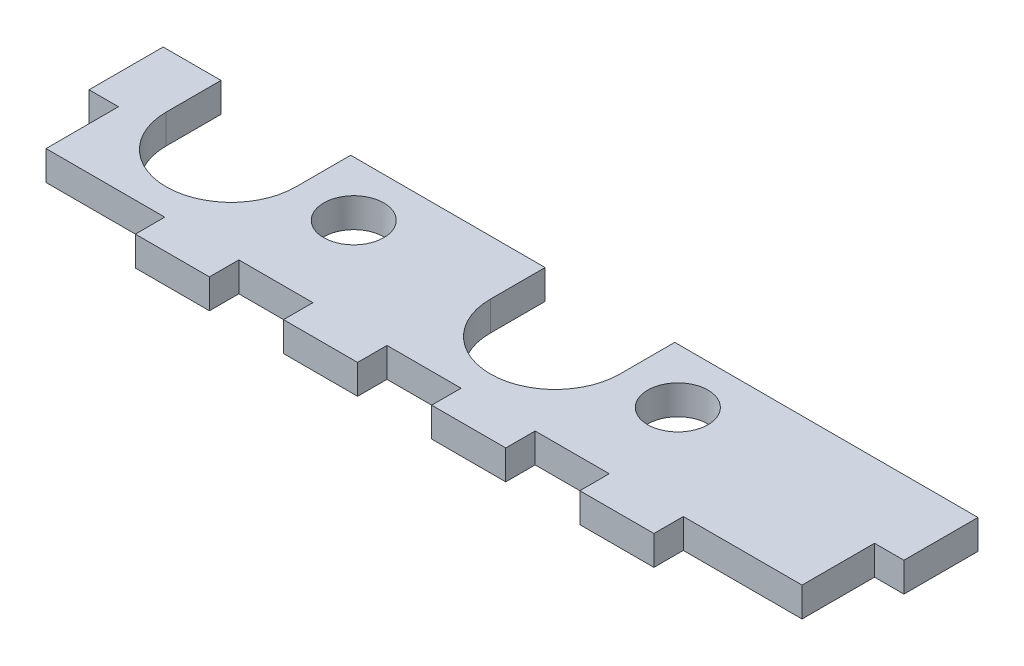
ISO-10303-21;
HEADER;
FILE_DESCRIPTION(('STEP AP214'),'2;1');
FILE_NAME('part.step','',(''),(''),'','','');
FILE_SCHEMA(('AUTOMOTIVE_DESIGN { 1 0 10303 214 1 1 1 1 }'));
ENDSEC;
DATA;
#1=APPLICATION_CONTEXT('core data for automotive mechanical design processes');
#2=APPLICATION_PROTOCOL_DEFINITION('international standard','automotive_design',2000,#1);
#3=PRODUCT_CONTEXT('',#1,'mechanical');
#4=PRODUCT('Part','Part','',(#3));
#5=PRODUCT_RELATED_PRODUCT_CATEGORY('part','',(#4));
#6=PRODUCT_DEFINITION_FORMATION('','',#4);
#7=PRODUCT_DEFINITION_CONTEXT('part definition',#1,'design');
#8=PRODUCT_DEFINITION('design','',#6,#7);
#9=PRODUCT_DEFINITION_SHAPE('','',#8);
#10=(LENGTH_UNIT() NAMED_UNIT(*) SI_UNIT(.MILLI.,.METRE.));
#11=(NAMED_UNIT(*) PLANE_ANGLE_UNIT() SI_UNIT($,.RADIAN.));
#12=(NAMED_UNIT(*) SI_UNIT($,.STERADIAN.) SOLID_ANGLE_UNIT());
#13=UNCERTAINTY_MEASURE_WITH_UNIT(LENGTH_MEASURE(1.E-05),#10,'distance_accuracy_value','');
#14=(GEOMETRIC_REPRESENTATION_CONTEXT(3) GLOBAL_UNCERTAINTY_ASSIGNED_CONTEXT((#13)) GLOBAL_UNIT_ASSIGNED_CONTEXT((#10,
#11,#12)) REPRESENTATION_CONTEXT('',''));
#15=CARTESIAN_POINT('',(0.,0.,0.));
#16=DIRECTION('',(0.,0.,1.));
#17=DIRECTION('',(1.,0.,0.));
#18=AXIS2_PLACEMENT_3D('',#15,#16,#17);
#19=CARTESIAN_POINT('',(0.,-0.00100000000000013,11.));
#20=DIRECTION('',(0.,0.,-1.));
#21=DIRECTION('',(-1.,0.,0.));
#22=AXIS2_PLACEMENT_3D('',#19,#20,#21);
#23=PLANE('',#22);
#24=DIRECTION('',(0.,1.,0.));
#25=VECTOR('',#24,1.);
#26=CARTESIAN_POINT('',(41.25,-0.00100000000000013,10.9999999999995));
#27=LINE('',#26,#25);
#28=CARTESIAN_POINT('',(41.25,0.,10.9999999999995));
#29=VERTEX_POINT('',#28);
#30=CARTESIAN_POINT('',(41.25,3.175,10.9999999999995));
#31=VERTEX_POINT('',#30);
#32=EDGE_CURVE('E306',#29,#31,#27,.T.);
#33=ORIENTED_EDGE('',*,*,#32,.F.);
#34=DIRECTION('',(1.,0.,0.));
#35=VECTOR('',#34,1.);
#36=CARTESIAN_POINT('',(0.,0.,11.));
#37=LINE('',#36,#35);
#38=CARTESIAN_POINT('',(20.25,0.,11.));
#39=VERTEX_POINT('',#38);
#40=EDGE_CURVE('E393',#39,#29,#37,.T.);
#41=ORIENTED_EDGE('',*,*,#40,.F.);
#42=DIRECTION('',(0.,1.,0.));
#43=VECTOR('',#42,1.);
#44=CARTESIAN_POINT('',(20.25,-0.00100000000000013,11.));
#45=LINE('',#44,#43);
#46=CARTESIAN_POINT('',(20.25,3.175,11.));
#47=VERTEX_POINT('',#46);
#48=EDGE_CURVE('E327',#39,#47,#45,.T.);
#49=ORIENTED_EDGE('',*,*,#48,.T.);
#50=DIRECTION('',(-1.,0.,0.));
#51=VECTOR('',#50,1.);
#52=CARTESIAN_POINT('',(0.,3.175,11.));
#53=LINE('',#52,#51);
#54=EDGE_CURVE('E88',#31,#47,#53,.T.);
#55=ORIENTED_EDGE('',*,*,#54,.F.);
#56=EDGE_LOOP('',(#33,#41,#49,#55));
#57=FACE_BOUND('',#56,.T.);
#58=ADVANCED_FACE('F63',(#57),#23,.T.);
#59=DIRECTION('',(0.,1.,0.));
#60=VECTOR('',#59,1.);
#61=CARTESIAN_POINT('',(6.25,-0.00100000000000013,11.));
#62=LINE('',#61,#60);
#63=CARTESIAN_POINT('',(6.25,0.,11.));
#64=VERTEX_POINT('',#63);
#65=CARTESIAN_POINT('',(6.25,3.175,11.));
#66=VERTEX_POINT('',#65);
#67=EDGE_CURVE('E325',#64,#66,#62,.T.);
#68=ORIENTED_EDGE('',*,*,#67,.F.);
#69=CARTESIAN_POINT('',(0.,0.,11.));
#70=VERTEX_POINT('',#69);
#71=EDGE_CURVE('E389',#70,#64,#37,.T.);
#72=ORIENTED_EDGE('',*,*,#71,.F.);
#73=DIRECTION('',(0.,1.,0.));
#74=VECTOR('',#73,1.);
#75=CARTESIAN_POINT('',(0.,-0.00100000000000013,11.));
#76=LINE('',#75,#74);
#77=CARTESIAN_POINT('',(0.,3.175,11.));
#78=VERTEX_POINT('',#77);
#79=EDGE_CURVE('E346',#70,#78,#76,.T.);
#80=ORIENTED_EDGE('',*,*,#79,.T.);
#81=EDGE_CURVE('E384',#66,#78,#53,.T.);
#82=ORIENTED_EDGE('',*,*,#81,.F.);
#83=EDGE_LOOP('',(#68,#72,#80,#82));
#84=FACE_BOUND('',#83,.T.);
#85=ADVANCED_FACE('F582',(#84),#23,.T.);
#86=CARTESIAN_POINT('',(0.,3.175,30.));
#87=DIRECTION('',(0.,0.,-1.));
#88=DIRECTION('',(-1.,0.,0.));
#89=AXIS2_PLACEMENT_3D('',#86,#87,#88);
#90=PLANE('',#89);
#91=DIRECTION('',(0.,1.,0.));
#92=VECTOR('',#91,1.);
#93=CARTESIAN_POINT('',(72.,-0.00100000000000013,30.));
#94=LINE('',#93,#92);
#95=CARTESIAN_POINT('',(72.,0.,30.));
#96=VERTEX_POINT('',#95);
#97=CARTESIAN_POINT('',(72.,3.175,30.));
#98=VERTEX_POINT('',#97);
#99=EDGE_CURVE('E352',#96,#98,#94,.T.);
#100=ORIENTED_EDGE('',*,*,#99,.T.);
#101=DIRECTION('',(1.,0.,0.));
#102=VECTOR('',#101,1.);
#103=CARTESIAN_POINT('',(0.,3.175,30.));
#104=LINE('',#103,#102);
#105=CARTESIAN_POINT('',(64.,3.175,30.));
#106=VERTEX_POINT('',#105);
#107=EDGE_CURVE('E507',#106,#98,#104,.T.);
#108=ORIENTED_EDGE('',*,*,#107,.F.);
#109=DIRECTION('',(0.,1.,0.));
#110=VECTOR('',#109,1.);
#111=CARTESIAN_POINT('',(64.,-0.00100000000000013,30.));
#112=LINE('',#111,#110);
#113=CARTESIAN_POINT('',(64.,0.,30.));
#114=VERTEX_POINT('',#113);
#115=EDGE_CURVE('E449',#114,#106,#112,.T.);
#116=ORIENTED_EDGE('',*,*,#115,.F.);
#117=DIRECTION('',(1.,0.,0.));
#118=VECTOR('',#117,1.);
#119=CARTESIAN_POINT('',(0.,0.,30.));
#120=LINE('',#119,#118);
#121=EDGE_CURVE('E511',#114,#96,#120,.T.);
#122=ORIENTED_EDGE('',*,*,#121,.T.);
#123=EDGE_LOOP('',(#100,#108,#116,#122));
#124=FACE_BOUND('',#123,.T.);
#125=ADVANCED_FACE('F547',(#124),#90,.F.);
#126=DIRECTION('',(0.,1.,0.));
#127=VECTOR('',#126,1.);
#128=CARTESIAN_POINT('',(56.,-0.00100000000000013,30.));
#129=LINE('',#128,#127);
#130=CARTESIAN_POINT('',(56.,0.,30.));
#131=VERTEX_POINT('',#130);
#132=CARTESIAN_POINT('',(56.,3.175,30.));
#133=VERTEX_POINT('',#132);
#134=EDGE_CURVE('E448',#131,#133,#129,.T.);
#135=ORIENTED_EDGE('',*,*,#134,.T.);
#136=CARTESIAN_POINT('',(48.,3.175,30.));
#137=VERTEX_POINT('',#136);
#138=EDGE_CURVE('E542',#137,#133,#104,.T.);
#139=ORIENTED_EDGE('',*,*,#138,.F.);
#140=DIRECTION('',(0.,1.,0.));
#141=VECTOR('',#140,1.);
#142=CARTESIAN_POINT('',(48.,-0.00100000000000013,30.));
#143=LINE('',#142,#141);
#144=CARTESIAN_POINT('',(48.,0.,30.));
#145=VERTEX_POINT('',#144);
#146=EDGE_CURVE('E425',#145,#137,#143,.T.);
#147=ORIENTED_EDGE('',*,*,#146,.F.);
#148=EDGE_CURVE('E520',#145,#131,#120,.T.);
#149=ORIENTED_EDGE('',*,*,#148,.T.);
#150=EDGE_LOOP('',(#135,#139,#147,#149));
#151=FACE_BOUND('',#150,.T.);
#152=ADVANCED_FACE('F529',(#151),#90,.F.);
#153=DIRECTION('',(0.,1.,0.));
#154=VECTOR('',#153,1.);
#155=CARTESIAN_POINT('',(40.,-0.00100000000000013,30.));
#156=LINE('',#155,#154);
#157=CARTESIAN_POINT('',(40.,0.,30.));
#158=VERTEX_POINT('',#157);
#159=CARTESIAN_POINT('',(40.,3.175,30.));
#160=VERTEX_POINT('',#159);
#161=EDGE_CURVE('E421',#158,#160,#156,.T.);
#162=ORIENTED_EDGE('',*,*,#161,.T.);
#163=CARTESIAN_POINT('',(32.,3.175,30.));
#164=VERTEX_POINT('',#163);
#165=EDGE_CURVE('E509',#164,#160,#104,.T.);
#166=ORIENTED_EDGE('',*,*,#165,.F.);
#167=DIRECTION('',(0.,1.,0.));
#168=VECTOR('',#167,1.);
#169=CARTESIAN_POINT('',(32.,-0.00100000000000013,30.));
#170=LINE('',#169,#168);
#171=CARTESIAN_POINT('',(32.,0.,30.));
#172=VERTEX_POINT('',#171);
#173=EDGE_CURVE('E398',#172,#164,#170,.T.);
#174=ORIENTED_EDGE('',*,*,#173,.F.);
#175=EDGE_CURVE('E514',#172,#158,#120,.T.);
#176=ORIENTED_EDGE('',*,*,#175,.T.);
#177=EDGE_LOOP('',(#162,#166,#174,#176));
#178=FACE_BOUND('',#177,.T.);
#179=ADVANCED_FACE('F618',(#178),#90,.F.);
#180=DIRECTION('',(0.,1.,0.));
#181=VECTOR('',#180,1.);
#182=CARTESIAN_POINT('',(24.,-0.00100000000000013,30.));
#183=LINE('',#182,#181);
#184=CARTESIAN_POINT('',(24.,0.,30.));
#185=VERTEX_POINT('',#184);
#186=CARTESIAN_POINT('',(24.,3.175,30.));
#187=VERTEX_POINT('',#186);
#188=EDGE_CURVE('E396',#185,#187,#183,.T.);
#189=ORIENTED_EDGE('',*,*,#188,.T.);
#190=CARTESIAN_POINT('',(16.,3.175,30.));
#191=VERTEX_POINT('',#190);
#192=EDGE_CURVE('E72',#191,#187,#104,.T.);
#193=ORIENTED_EDGE('',*,*,#192,.F.);
#194=DIRECTION('',(0.,1.,0.));
#195=VECTOR('',#194,1.);
#196=CARTESIAN_POINT('',(16.,-0.00100000000000013,30.));
#197=LINE('',#196,#195);
#198=CARTESIAN_POINT('',(16.,0.,30.));
#199=VERTEX_POINT('',#198);
#200=EDGE_CURVE('E496',#199,#191,#197,.T.);
#201=ORIENTED_EDGE('',*,*,#200,.F.);
#202=EDGE_CURVE('E512',#199,#185,#120,.T.);
#203=ORIENTED_EDGE('',*,*,#202,.T.);
#204=EDGE_LOOP('',(#189,#193,#201,#203));
#205=FACE_BOUND('',#204,.T.);
#206=ADVANCED_FACE('F601',(#205),#90,.F.);
#207=CARTESIAN_POINT('',(88.,3.175,0.));
#208=DIRECTION('',(-1.,0.,0.));
#209=DIRECTION('',(0.,0.,1.));
#210=AXIS2_PLACEMENT_3D('',#207,#208,#209);
#211=PLANE('',#210);
#212=DIRECTION('',(0.,1.,0.));
#213=VECTOR('',#212,1.);
#214=CARTESIAN_POINT('',(88.,-0.00100000000000013,11.));
#215=LINE('',#214,#213);
#216=CARTESIAN_POINT('',(88.,0.,11.));
#217=VERTEX_POINT('',#216);
#218=CARTESIAN_POINT('',(88.,3.175,11.));
#219=VERTEX_POINT('',#218);
#220=EDGE_CURVE('E349',#217,#219,#215,.T.);
#221=ORIENTED_EDGE('',*,*,#220,.T.);
#222=DIRECTION('',(0.,0.,-1.));
#223=VECTOR('',#222,1.);
#224=CARTESIAN_POINT('',(88.,3.175,0.));
#225=LINE('',#224,#223);
#226=CARTESIAN_POINT('',(88.,3.175,19.));
#227=VERTEX_POINT('',#226);
#228=EDGE_CURVE('E12',#227,#219,#225,.T.);
#229=ORIENTED_EDGE('',*,*,#228,.F.);
#230=DIRECTION('',(0.,1.,0.));
#231=VECTOR('',#230,1.);
#232=CARTESIAN_POINT('',(88.,-0.00100000000000013,19.));
#233=LINE('',#232,#231);
#234=CARTESIAN_POINT('',(88.,0.,19.));
#235=VERTEX_POINT('',#234);
#236=EDGE_CURVE('E353',#235,#227,#233,.T.);
#237=ORIENTED_EDGE('',*,*,#236,.F.);
#238=DIRECTION('',(0.,0.,-1.));
#239=VECTOR('',#238,1.);
#240=CARTESIAN_POINT('',(88.,0.,0.));
#241=LINE('',#240,#239);
#242=EDGE_CURVE('E67',#235,#217,#241,.T.);
#243=ORIENTED_EDGE('',*,*,#242,.T.);
#244=EDGE_LOOP('',(#221,#229,#237,#243));
#245=FACE_BOUND('',#244,.T.);
#246=ADVANCED_FACE('F565',(#245),#211,.F.);
#247=CARTESIAN_POINT('',(0.,3.175,0.));
#248=DIRECTION('',(0.,1.,0.));
#249=DIRECTION('',(0.,0.,1.));
#250=AXIS2_PLACEMENT_3D('',#247,#248,#249);
#251=PLANE('',#250);
#252=DIRECTION('',(0.,0.,1.));
#253=VECTOR('',#252,1.);
#254=CARTESIAN_POINT('',(41.25,3.175,16.9149999999995));
#255=LINE('',#254,#253);
#256=CARTESIAN_POINT('',(41.25,3.175,16.9149999999995));
#257=VERTEX_POINT('',#256);
#258=EDGE_CURVE('E285',#31,#257,#255,.T.);
#259=ORIENTED_EDGE('',*,*,#258,.F.);
#260=ORIENTED_EDGE('',*,*,#54,.T.);
#261=DIRECTION('',(0.,0.,-1.));
#262=VECTOR('',#261,1.);
#263=CARTESIAN_POINT('',(20.25,3.175,16.915));
#264=LINE('',#263,#262);
#265=CARTESIAN_POINT('',(20.25,3.175,16.915));
#266=VERTEX_POINT('',#265);
#267=EDGE_CURVE('E316',#266,#47,#264,.T.);
#268=ORIENTED_EDGE('',*,*,#267,.F.);
#269=CARTESIAN_POINT('',(13.25,3.175,16.915));
#270=DIRECTION('',(0.,1.,0.));
#271=DIRECTION('',(0.,0.,1.));
#272=AXIS2_PLACEMENT_3D('',#269,#270,#271);
#273=CIRCLE('',#272,7.);
#274=CARTESIAN_POINT('',(6.25,3.175,16.915));
#275=VERTEX_POINT('',#274);
#276=EDGE_CURVE('E313',#275,#266,#273,.T.);
#277=ORIENTED_EDGE('',*,*,#276,.F.);
#278=DIRECTION('',(0.,0.,1.));
#279=VECTOR('',#278,1.);
#280=CARTESIAN_POINT('',(6.25,3.175,16.915));
#281=LINE('',#280,#279);
#282=EDGE_CURVE('E318',#66,#275,#281,.T.);
#283=ORIENTED_EDGE('',*,*,#282,.F.);
#284=ORIENTED_EDGE('',*,*,#81,.T.);
#285=DIRECTION('',(0.,0.,1.));
#286=VECTOR('',#285,1.);
#287=CARTESIAN_POINT('',(0.,3.175,0.));
#288=LINE('',#287,#286);
#289=CARTESIAN_POINT('',(0.,3.175,19.));
#290=VERTEX_POINT('',#289);
#291=EDGE_CURVE('E505',#78,#290,#288,.T.);
#292=ORIENTED_EDGE('',*,*,#291,.T.);
#293=DIRECTION('',(1.,0.,0.));
#294=VECTOR('',#293,1.);
#295=CARTESIAN_POINT('',(0.,3.175,19.));
#296=LINE('',#295,#294);
#297=CARTESIAN_POINT('',(3.175,3.175,19.));
#298=VERTEX_POINT('',#297);
#299=EDGE_CURVE('E481',#290,#298,#296,.T.);
#300=ORIENTED_EDGE('',*,*,#299,.T.);
#301=DIRECTION('',(0.,0.,1.));
#302=VECTOR('',#301,1.);
#303=CARTESIAN_POINT('',(3.175,3.175,0.));
#304=LINE('',#303,#302);
#305=CARTESIAN_POINT('',(3.175,3.175,26.825));
#306=VERTEX_POINT('',#305);
#307=EDGE_CURVE('E478',#298,#306,#304,.T.);
#308=ORIENTED_EDGE('',*,*,#307,.T.);
#309=DIRECTION('',(1.,0.,0.));
#310=VECTOR('',#309,1.);
#311=CARTESIAN_POINT('',(0.,3.175,26.825));
#312=LINE('',#311,#310);
#313=CARTESIAN_POINT('',(16.,3.175,26.825));
#314=VERTEX_POINT('',#313);
#315=EDGE_CURVE('E487',#306,#314,#312,.T.);
#316=ORIENTED_EDGE('',*,*,#315,.T.);
#317=DIRECTION('',(0.,0.,-1.));
#318=VECTOR('',#317,1.);
#319=CARTESIAN_POINT('',(16.,3.175,0.));
#320=LINE('',#319,#318);
#321=EDGE_CURVE('E484',#191,#314,#320,.T.);
#322=ORIENTED_EDGE('',*,*,#321,.F.);
#323=ORIENTED_EDGE('',*,*,#192,.T.);
#324=DIRECTION('',(0.,0.,-1.));
#325=VECTOR('',#324,1.);
#326=CARTESIAN_POINT('',(24.,3.175,0.));
#327=LINE('',#326,#325);
#328=CARTESIAN_POINT('',(24.,3.175,26.825));
#329=VERTEX_POINT('',#328);
#330=EDGE_CURVE('E400',#187,#329,#327,.T.);
#331=ORIENTED_EDGE('',*,*,#330,.T.);
#332=DIRECTION('',(-1.,0.,0.));
#333=VECTOR('',#332,1.);
#334=CARTESIAN_POINT('',(0.,3.175,26.825));
#335=LINE('',#334,#333);
#336=CARTESIAN_POINT('',(32.,3.175,26.825));
#337=VERTEX_POINT('',#336);
#338=EDGE_CURVE('E409',#337,#329,#335,.T.);
#339=ORIENTED_EDGE('',*,*,#338,.F.);
#340=DIRECTION('',(0.,0.,-1.));
#341=VECTOR('',#340,1.);
#342=CARTESIAN_POINT('',(32.,3.175,0.));
#343=LINE('',#342,#341);
#344=EDGE_CURVE('E412',#164,#337,#343,.T.);
#345=ORIENTED_EDGE('',*,*,#344,.F.);
#346=ORIENTED_EDGE('',*,*,#165,.T.);
#347=DIRECTION('',(0.,0.,-1.));
#348=VECTOR('',#347,1.);
#349=CARTESIAN_POINT('',(40.,3.175,0.));
#350=LINE('',#349,#348);
#351=CARTESIAN_POINT('',(40.,3.175,26.825));
#352=VERTEX_POINT('',#351);
#353=EDGE_CURVE('E437',#160,#352,#350,.T.);
#354=ORIENTED_EDGE('',*,*,#353,.T.);
#355=DIRECTION('',(1.,0.,0.));
#356=VECTOR('',#355,1.);
#357=CARTESIAN_POINT('',(0.,3.175,26.825));
#358=LINE('',#357,#356);
#359=CARTESIAN_POINT('',(48.,3.175,26.825));
#360=VERTEX_POINT('',#359);
#361=EDGE_CURVE('E424',#352,#360,#358,.T.);
#362=ORIENTED_EDGE('',*,*,#361,.T.);
#363=DIRECTION('',(0.,0.,-1.));
#364=VECTOR('',#363,1.);
#365=CARTESIAN_POINT('',(48.,3.175,0.));
#366=LINE('',#365,#364);
#367=EDGE_CURVE('E434',#137,#360,#366,.T.);
#368=ORIENTED_EDGE('',*,*,#367,.F.);
#369=ORIENTED_EDGE('',*,*,#138,.T.);
#370=DIRECTION('',(0.,0.,-1.));
#371=VECTOR('',#370,1.);
#372=CARTESIAN_POINT('',(56.,3.175,0.));
#373=LINE('',#372,#371);
#374=CARTESIAN_POINT('',(56.,3.175,26.825));
#375=VERTEX_POINT('',#374);
#376=EDGE_CURVE('E451',#133,#375,#373,.T.);
#377=ORIENTED_EDGE('',*,*,#376,.T.);
#378=DIRECTION('',(1.,0.,0.));
#379=VECTOR('',#378,1.);
#380=CARTESIAN_POINT('',(0.,3.175,26.825));
#381=LINE('',#380,#379);
#382=CARTESIAN_POINT('',(64.,3.175,26.825));
#383=VERTEX_POINT('',#382);
#384=EDGE_CURVE('E460',#375,#383,#381,.T.);
#385=ORIENTED_EDGE('',*,*,#384,.T.);
#386=DIRECTION('',(0.,0.,-1.));
#387=VECTOR('',#386,1.);
#388=CARTESIAN_POINT('',(64.,3.175,0.));
#389=LINE('',#388,#387);
#390=EDGE_CURVE('E463',#106,#383,#389,.T.);
#391=ORIENTED_EDGE('',*,*,#390,.F.);
#392=ORIENTED_EDGE('',*,*,#107,.T.);
#393=DIRECTION('',(0.,0.,-1.));
#394=VECTOR('',#393,1.);
#395=CARTESIAN_POINT('',(72.,3.175,0.));
#396=LINE('',#395,#394);
#397=CARTESIAN_POINT('',(72.,3.175,26.825));
#398=VERTEX_POINT('',#397);
#399=EDGE_CURVE('E355',#98,#398,#396,.T.);
#400=ORIENTED_EDGE('',*,*,#399,.T.);
#401=DIRECTION('',(-1.,0.,0.));
#402=VECTOR('',#401,1.);
#403=CARTESIAN_POINT('',(0.,3.175,26.825));
#404=LINE('',#403,#402);
#405=CARTESIAN_POINT('',(84.825,3.175,26.825));
#406=VERTEX_POINT('',#405);
#407=EDGE_CURVE('E366',#406,#398,#404,.T.);
#408=ORIENTED_EDGE('',*,*,#407,.F.);
#409=DIRECTION('',(0.,0.,1.));
#410=VECTOR('',#409,1.);
#411=CARTESIAN_POINT('',(84.825,3.175,0.));
#412=LINE('',#411,#410);
#413=CARTESIAN_POINT('',(84.825,3.175,19.));
#414=VERTEX_POINT('',#413);
#415=EDGE_CURVE('E369',#414,#406,#412,.T.);
#416=ORIENTED_EDGE('',*,*,#415,.F.);
#417=DIRECTION('',(-1.,0.,0.));
#418=VECTOR('',#417,1.);
#419=CARTESIAN_POINT('',(0.,3.175,19.));
#420=LINE('',#419,#418);
#421=EDGE_CURVE('E372',#227,#414,#420,.T.);
#422=ORIENTED_EDGE('',*,*,#421,.F.);
#423=ORIENTED_EDGE('',*,*,#228,.T.);
#424=CARTESIAN_POINT('',(55.25,3.175,11.));
#425=VERTEX_POINT('',#424);
#426=EDGE_CURVE('E385',#219,#425,#53,.T.);
#427=ORIENTED_EDGE('',*,*,#426,.T.);
#428=DIRECTION('',(0.,0.,-1.));
#429=VECTOR('',#428,1.);
#430=CARTESIAN_POINT('',(55.25,3.175,16.9149999999995));
#431=LINE('',#430,#429);
#432=CARTESIAN_POINT('',(55.25,3.175,16.9149999999995));
#433=VERTEX_POINT('',#432);
#434=EDGE_CURVE('E80',#433,#425,#431,.T.);
#435=ORIENTED_EDGE('',*,*,#434,.F.);
#436=CARTESIAN_POINT('',(48.25,3.175,16.9149999999995));
#437=DIRECTION('',(0.,1.,0.));
#438=DIRECTION('',(0.,0.,1.));
#439=AXIS2_PLACEMENT_3D('',#436,#437,#438);
#440=CIRCLE('',#439,7.);
#441=EDGE_CURVE('E283',#257,#433,#440,.T.);
#442=ORIENTED_EDGE('',*,*,#441,.F.);
#443=EDGE_LOOP('',(#259,#260,#268,#277,#283,#284,#292,#300,#308,#316,#322,#323,#331,#339,#345,
#346,#354,#362,#368,#369,#377,#385,#391,#392,#400,#408,#416,#422,#423,#427,#435,#442));
#444=FACE_BOUND('',#443,.T.);
#445=CARTESIAN_POINT('',(26.5,3.175,16.915));
#446=DIRECTION('',(0.,1.,0.));
#447=DIRECTION('',(0.,0.,-1.));
#448=AXIS2_PLACEMENT_3D('',#445,#446,#447);
#449=CIRCLE('',#448,3.24999999999999);
#450=CARTESIAN_POINT('',(26.5,3.175,13.665));
#451=VERTEX_POINT('',#450);
#452=EDGE_CURVE('E333',#451,#451,#449,.T.);
#453=ORIENTED_EDGE('',*,*,#452,.F.);
#454=EDGE_LOOP('',(#453));
#455=FACE_BOUND('',#454,.T.);
#456=CARTESIAN_POINT('',(61.5,3.175,16.915));
#457=DIRECTION('',(0.,1.,0.));
#458=DIRECTION('',(0.,0.,1.));
#459=AXIS2_PLACEMENT_3D('',#456,#457,#458);
#460=CIRCLE('',#459,3.24999999999999);
#461=CARTESIAN_POINT('',(61.5,3.175,20.165));
#462=VERTEX_POINT('',#461);
#463=EDGE_CURVE('E339',#462,#462,#460,.T.);
#464=ORIENTED_EDGE('',*,*,#463,.F.);
#465=EDGE_LOOP('',(#464));
#466=FACE_BOUND('',#465,.T.);
#467=ADVANCED_FACE('F538',(#444,#455,#466),#251,.T.);
#468=CARTESIAN_POINT('',(0.,0.,0.));
#469=DIRECTION('',(0.,1.,0.));
#470=DIRECTION('',(0.,0.,1.));
#471=AXIS2_PLACEMENT_3D('',#468,#469,#470);
#472=PLANE('',#471);
#473=CARTESIAN_POINT('',(26.5,0.,16.915));
#474=DIRECTION('',(0.,1.,0.));
#475=DIRECTION('',(0.,0.,1.));
#476=AXIS2_PLACEMENT_3D('',#473,#474,#475);
#477=CIRCLE('',#476,3.24999999999999);
#478=CARTESIAN_POINT('',(26.5,0.,20.165));
#479=VERTEX_POINT('',#478);
#480=EDGE_CURVE('E336',#479,#479,#477,.F.);
#481=ORIENTED_EDGE('',*,*,#480,.F.);
#482=EDGE_LOOP('',(#481));
#483=FACE_BOUND('',#482,.T.);
#484=CARTESIAN_POINT('',(61.5,0.,16.915));
#485=DIRECTION('',(0.,1.,0.));
#486=DIRECTION('',(0.,0.,1.));
#487=AXIS2_PLACEMENT_3D('',#484,#485,#486);
#488=CIRCLE('',#487,3.24999999999999);
#489=CARTESIAN_POINT('',(61.5,0.,20.165));
#490=VERTEX_POINT('',#489);
#491=EDGE_CURVE('E342',#490,#490,#488,.F.);
#492=ORIENTED_EDGE('',*,*,#491,.F.);
#493=EDGE_LOOP('',(#492));
#494=FACE_BOUND('',#493,.T.);
#495=ORIENTED_EDGE('',*,*,#40,.T.);
#496=DIRECTION('',(0.,0.,-1.));
#497=VECTOR('',#496,1.);
#498=CARTESIAN_POINT('',(41.25,0.,16.9149999999995));
#499=LINE('',#498,#497);
#500=CARTESIAN_POINT('',(41.25,0.,16.9149999999995));
#501=VERTEX_POINT('',#500);
#502=EDGE_CURVE('E297',#501,#29,#499,.T.);
#503=ORIENTED_EDGE('',*,*,#502,.F.);
#504=CARTESIAN_POINT('',(48.25,0.,16.9149999999995));
#505=DIRECTION('',(0.,1.,0.));
#506=DIRECTION('',(0.,0.,1.));
#507=AXIS2_PLACEMENT_3D('',#504,#505,#506);
#508=CIRCLE('',#507,7.);
#509=CARTESIAN_POINT('',(55.25,0.,16.9149999999995));
#510=VERTEX_POINT('',#509);
#511=EDGE_CURVE('E280',#510,#501,#508,.F.);
#512=ORIENTED_EDGE('',*,*,#511,.F.);
#513=DIRECTION('',(0.,0.,1.));
#514=VECTOR('',#513,1.);
#515=CARTESIAN_POINT('',(55.25,0.,16.9149999999995));
#516=LINE('',#515,#514);
#517=CARTESIAN_POINT('',(55.25,0.,10.9999999999995));
#518=VERTEX_POINT('',#517);
#519=EDGE_CURVE('E288',#518,#510,#516,.T.);
#520=ORIENTED_EDGE('',*,*,#519,.F.);
#521=EDGE_CURVE('E388',#518,#217,#37,.T.);
#522=ORIENTED_EDGE('',*,*,#521,.T.);
#523=ORIENTED_EDGE('',*,*,#242,.F.);
#524=DIRECTION('',(1.,0.,0.));
#525=VECTOR('',#524,1.);
#526=CARTESIAN_POINT('',(0.,0.,19.));
#527=LINE('',#526,#525);
#528=CARTESIAN_POINT('',(84.825,0.,19.));
#529=VERTEX_POINT('',#528);
#530=EDGE_CURVE('E345',#529,#235,#527,.T.);
#531=ORIENTED_EDGE('',*,*,#530,.F.);
#532=DIRECTION('',(0.,0.,-1.));
#533=VECTOR('',#532,1.);
#534=CARTESIAN_POINT('',(84.825,0.,0.));
#535=LINE('',#534,#533);
#536=CARTESIAN_POINT('',(84.825,0.,26.825));
#537=VERTEX_POINT('',#536);
#538=EDGE_CURVE('E350',#537,#529,#535,.T.);
#539=ORIENTED_EDGE('',*,*,#538,.F.);
#540=DIRECTION('',(1.,0.,0.));
#541=VECTOR('',#540,1.);
#542=CARTESIAN_POINT('',(0.,0.,26.825));
#543=LINE('',#542,#541);
#544=CARTESIAN_POINT('',(72.,0.,26.825));
#545=VERTEX_POINT('',#544);
#546=EDGE_CURVE('E378',#545,#537,#543,.T.);
#547=ORIENTED_EDGE('',*,*,#546,.F.);
#548=DIRECTION('',(0.,0.,1.));
#549=VECTOR('',#548,1.);
#550=CARTESIAN_POINT('',(72.,0.,0.));
#551=LINE('',#550,#549);
#552=EDGE_CURVE('E375',#545,#96,#551,.T.);
#553=ORIENTED_EDGE('',*,*,#552,.T.);
#554=ORIENTED_EDGE('',*,*,#121,.F.);
#555=DIRECTION('',(0.,0.,1.));
#556=VECTOR('',#555,1.);
#557=CARTESIAN_POINT('',(64.,0.,0.));
#558=LINE('',#557,#556);
#559=CARTESIAN_POINT('',(64.,0.,26.825));
#560=VERTEX_POINT('',#559);
#561=EDGE_CURVE('E392',#560,#114,#558,.T.);
#562=ORIENTED_EDGE('',*,*,#561,.F.);
#563=DIRECTION('',(-1.,0.,0.));
#564=VECTOR('',#563,1.);
#565=CARTESIAN_POINT('',(0.,0.,26.825));
#566=LINE('',#565,#564);
#567=CARTESIAN_POINT('',(56.,0.,26.825));
#568=VERTEX_POINT('',#567);
#569=EDGE_CURVE('E431',#560,#568,#566,.T.);
#570=ORIENTED_EDGE('',*,*,#569,.T.);
#571=DIRECTION('',(0.,0.,1.));
#572=VECTOR('',#571,1.);
#573=CARTESIAN_POINT('',(56.,0.,0.));
#574=LINE('',#573,#572);
#575=EDGE_CURVE('E466',#568,#131,#574,.T.);
#576=ORIENTED_EDGE('',*,*,#575,.T.);
#577=ORIENTED_EDGE('',*,*,#148,.F.);
#578=DIRECTION('',(0.,0.,1.));
#579=VECTOR('',#578,1.);
#580=CARTESIAN_POINT('',(48.,0.,0.));
#581=LINE('',#580,#579);
#582=CARTESIAN_POINT('',(48.,0.,26.825));
#583=VERTEX_POINT('',#582);
#584=EDGE_CURVE('E397',#583,#145,#581,.T.);
#585=ORIENTED_EDGE('',*,*,#584,.F.);
#586=DIRECTION('',(-1.,0.,0.));
#587=VECTOR('',#586,1.);
#588=CARTESIAN_POINT('',(0.,0.,26.825));
#589=LINE('',#588,#587);
#590=CARTESIAN_POINT('',(40.,0.,26.825));
#591=VERTEX_POINT('',#590);
#592=EDGE_CURVE('E443',#583,#591,#589,.T.);
#593=ORIENTED_EDGE('',*,*,#592,.T.);
#594=DIRECTION('',(0.,0.,1.));
#595=VECTOR('',#594,1.);
#596=CARTESIAN_POINT('',(40.,0.,0.));
#597=LINE('',#596,#595);
#598=EDGE_CURVE('E440',#591,#158,#597,.T.);
#599=ORIENTED_EDGE('',*,*,#598,.T.);
#600=ORIENTED_EDGE('',*,*,#175,.F.);
#601=DIRECTION('',(0.,0.,1.));
#602=VECTOR('',#601,1.);
#603=CARTESIAN_POINT('',(32.,0.,0.));
#604=LINE('',#603,#602);
#605=CARTESIAN_POINT('',(32.,0.,26.825));
#606=VERTEX_POINT('',#605);
#607=EDGE_CURVE('E394',#606,#172,#604,.T.);
#608=ORIENTED_EDGE('',*,*,#607,.F.);
#609=DIRECTION('',(1.,0.,0.));
#610=VECTOR('',#609,1.);
#611=CARTESIAN_POINT('',(0.,0.,26.825));
#612=LINE('',#611,#610);
#613=CARTESIAN_POINT('',(24.,0.,26.825));
#614=VERTEX_POINT('',#613);
#615=EDGE_CURVE('E418',#614,#606,#612,.T.);
#616=ORIENTED_EDGE('',*,*,#615,.F.);
#617=DIRECTION('',(0.,0.,1.));
#618=VECTOR('',#617,1.);
#619=CARTESIAN_POINT('',(24.,0.,0.));
#620=LINE('',#619,#618);
#621=EDGE_CURVE('E415',#614,#185,#620,.T.);
#622=ORIENTED_EDGE('',*,*,#621,.T.);
#623=ORIENTED_EDGE('',*,*,#202,.F.);
#624=DIRECTION('',(0.,0.,1.));
#625=VECTOR('',#624,1.);
#626=CARTESIAN_POINT('',(16.,0.,0.));
#627=LINE('',#626,#625);
#628=CARTESIAN_POINT('',(16.,0.,26.825));
#629=VERTEX_POINT('',#628);
#630=EDGE_CURVE('E476',#629,#199,#627,.T.);
#631=ORIENTED_EDGE('',*,*,#630,.F.);
#632=DIRECTION('',(-1.,0.,0.));
#633=VECTOR('',#632,1.);
#634=CARTESIAN_POINT('',(0.,0.,26.825));
#635=LINE('',#634,#633);
#636=CARTESIAN_POINT('',(3.175,0.,26.825));
#637=VERTEX_POINT('',#636);
#638=EDGE_CURVE('E473',#629,#637,#635,.T.);
#639=ORIENTED_EDGE('',*,*,#638,.T.);
#640=DIRECTION('',(0.,0.,-1.));
#641=VECTOR('',#640,1.);
#642=CARTESIAN_POINT('',(3.175,0.,0.));
#643=LINE('',#642,#641);
#644=CARTESIAN_POINT('',(3.175,0.,19.));
#645=VERTEX_POINT('',#644);
#646=EDGE_CURVE('E420',#637,#645,#643,.T.);
#647=ORIENTED_EDGE('',*,*,#646,.T.);
#648=DIRECTION('',(-1.,0.,0.));
#649=VECTOR('',#648,1.);
#650=CARTESIAN_POINT('',(0.,0.,19.));
#651=LINE('',#650,#649);
#652=CARTESIAN_POINT('',(0.,0.,19.));
#653=VERTEX_POINT('',#652);
#654=EDGE_CURVE('E493',#645,#653,#651,.T.);
#655=ORIENTED_EDGE('',*,*,#654,.T.);
#656=DIRECTION('',(0.,0.,1.));
#657=VECTOR('',#656,1.);
#658=CARTESIAN_POINT('',(0.,0.,0.));
#659=LINE('',#658,#657);
#660=EDGE_CURVE('E504',#70,#653,#659,.T.);
#661=ORIENTED_EDGE('',*,*,#660,.F.);
#662=ORIENTED_EDGE('',*,*,#71,.T.);
#663=DIRECTION('',(0.,0.,-1.));
#664=VECTOR('',#663,1.);
#665=CARTESIAN_POINT('',(6.25,0.,16.915));
#666=LINE('',#665,#664);
#667=CARTESIAN_POINT('',(6.25,0.,16.915));
#668=VERTEX_POINT('',#667);
#669=EDGE_CURVE('E311',#668,#64,#666,.T.);
#670=ORIENTED_EDGE('',*,*,#669,.F.);
#671=CARTESIAN_POINT('',(13.25,0.,16.915));
#672=DIRECTION('',(0.,1.,0.));
#673=DIRECTION('',(0.,0.,1.));
#674=AXIS2_PLACEMENT_3D('',#671,#672,#673);
#675=CIRCLE('',#674,7.);
#676=CARTESIAN_POINT('',(20.25,0.,16.915));
#677=VERTEX_POINT('',#676);
#678=EDGE_CURVE('E292',#677,#668,#675,.F.);
#679=ORIENTED_EDGE('',*,*,#678,.F.);
#680=DIRECTION('',(0.,0.,1.));
#681=VECTOR('',#680,1.);
#682=CARTESIAN_POINT('',(20.25,0.,16.915));
#683=LINE('',#682,#681);
#684=EDGE_CURVE('E324',#39,#677,#683,.T.);
#685=ORIENTED_EDGE('',*,*,#684,.F.);
#686=EDGE_LOOP('',(#495,#503,#512,#520,#522,#523,#531,#539,#547,#553,#554,#562,#570,#576,#577,
#585,#593,#599,#600,#608,#616,#622,#623,#631,#639,#647,#655,#661,#662,#670,#679,#685));
#687=FACE_BOUND('',#686,.T.);
#688=ADVANCED_FACE('F296',(#483,#494,#687),#472,.F.);
#689=CARTESIAN_POINT('',(0.,3.175,0.));
#690=DIRECTION('',(1.,0.,0.));
#691=DIRECTION('',(0.,0.,-1.));
#692=AXIS2_PLACEMENT_3D('',#689,#690,#691);
#693=PLANE('',#692);
#694=ORIENTED_EDGE('',*,*,#291,.F.);
#695=ORIENTED_EDGE('',*,*,#79,.F.);
#696=ORIENTED_EDGE('',*,*,#660,.T.);
#697=DIRECTION('',(0.,1.,0.));
#698=VECTOR('',#697,1.);
#699=CARTESIAN_POINT('',(0.,-0.00100000000000013,19.));
#700=LINE('',#699,#698);
#701=EDGE_CURVE('E498',#653,#290,#700,.T.);
#702=ORIENTED_EDGE('',*,*,#701,.T.);
#703=EDGE_LOOP('',(#694,#695,#696,#702));
#704=FACE_BOUND('',#703,.T.);
#705=ADVANCED_FACE('F65',(#704),#693,.F.);
#706=CARTESIAN_POINT('',(3.175,-0.00100000000000013,0.));
#707=DIRECTION('',(-1.,0.,0.));
#708=DIRECTION('',(0.,0.,1.));
#709=AXIS2_PLACEMENT_3D('',#706,#707,#708);
#710=PLANE('',#709);
#711=DIRECTION('',(0.,1.,0.));
#712=VECTOR('',#711,1.);
#713=CARTESIAN_POINT('',(3.175,-0.00100000000000013,26.825));
#714=LINE('',#713,#712);
#715=EDGE_CURVE('E491',#637,#306,#714,.T.);
#716=ORIENTED_EDGE('',*,*,#715,.T.);
#717=ORIENTED_EDGE('',*,*,#307,.F.);
#718=DIRECTION('',(0.,1.,0.));
#719=VECTOR('',#718,1.);
#720=CARTESIAN_POINT('',(3.175,-0.00100000000000013,19.));
#721=LINE('',#720,#719);
#722=EDGE_CURVE('E490',#645,#298,#721,.T.);
#723=ORIENTED_EDGE('',*,*,#722,.F.);
#724=ORIENTED_EDGE('',*,*,#646,.F.);
#725=EDGE_LOOP('',(#716,#717,#723,#724));
#726=FACE_BOUND('',#725,.T.);
#727=ADVANCED_FACE('F592',(#726),#710,.T.);
#728=CARTESIAN_POINT('',(0.,-0.00100000000000013,26.825));
#729=DIRECTION('',(0.,0.,1.));
#730=DIRECTION('',(1.,0.,0.));
#731=AXIS2_PLACEMENT_3D('',#728,#729,#730);
#732=PLANE('',#731);
#733=DIRECTION('',(0.,1.,0.));
#734=VECTOR('',#733,1.);
#735=CARTESIAN_POINT('',(16.,-0.00100000000000013,26.825));
#736=LINE('',#735,#734);
#737=EDGE_CURVE('E494',#629,#314,#736,.T.);
#738=ORIENTED_EDGE('',*,*,#737,.T.);
#739=ORIENTED_EDGE('',*,*,#315,.F.);
#740=ORIENTED_EDGE('',*,*,#715,.F.);
#741=ORIENTED_EDGE('',*,*,#638,.F.);
#742=EDGE_LOOP('',(#738,#739,#740,#741));
#743=FACE_BOUND('',#742,.T.);
#744=ADVANCED_FACE('F596',(#743),#732,.T.);
#745=CARTESIAN_POINT('',(16.,-0.00100000000000013,0.));
#746=DIRECTION('',(1.,0.,0.));
#747=DIRECTION('',(0.,0.,-1.));
#748=AXIS2_PLACEMENT_3D('',#745,#746,#747);
#749=PLANE('',#748);
#750=ORIENTED_EDGE('',*,*,#630,.T.);
#751=ORIENTED_EDGE('',*,*,#200,.T.);
#752=ORIENTED_EDGE('',*,*,#321,.T.);
#753=ORIENTED_EDGE('',*,*,#737,.F.);
#754=EDGE_LOOP('',(#750,#751,#752,#753));
#755=FACE_BOUND('',#754,.T.);
#756=ADVANCED_FACE('F876',(#755),#749,.F.);
#757=CARTESIAN_POINT('',(0.,-0.00100000000000013,19.));
#758=DIRECTION('',(0.,0.,1.));
#759=DIRECTION('',(1.,0.,0.));
#760=AXIS2_PLACEMENT_3D('',#757,#758,#759);
#761=PLANE('',#760);
#762=ORIENTED_EDGE('',*,*,#722,.T.);
#763=ORIENTED_EDGE('',*,*,#299,.F.);
#764=ORIENTED_EDGE('',*,*,#701,.F.);
#765=ORIENTED_EDGE('',*,*,#654,.F.);
#766=EDGE_LOOP('',(#762,#763,#764,#765));
#767=FACE_BOUND('',#766,.T.);
#768=ADVANCED_FACE('F587',(#767),#761,.T.);
#769=CARTESIAN_POINT('',(24.,-0.00100000000000013,0.));
#770=DIRECTION('',(1.,0.,0.));
#771=DIRECTION('',(0.,0.,-1.));
#772=AXIS2_PLACEMENT_3D('',#769,#770,#771);
#773=PLANE('',#772);
#774=DIRECTION('',(0.,1.,0.));
#775=VECTOR('',#774,1.);
#776=CARTESIAN_POINT('',(24.,-0.00100000000000013,26.825));
#777=LINE('',#776,#775);
#778=EDGE_CURVE('E403',#614,#329,#777,.T.);
#779=ORIENTED_EDGE('',*,*,#778,.T.);
#780=ORIENTED_EDGE('',*,*,#330,.F.);
#781=ORIENTED_EDGE('',*,*,#188,.F.);
#782=ORIENTED_EDGE('',*,*,#621,.F.);
#783=EDGE_LOOP('',(#779,#780,#781,#782));
#784=FACE_BOUND('',#783,.T.);
#785=ADVANCED_FACE('F604',(#784),#773,.T.);
#786=CARTESIAN_POINT('',(0.,-0.00100000000000013,26.825));
#787=DIRECTION('',(0.,0.,-1.));
#788=DIRECTION('',(-1.,0.,0.));
#789=AXIS2_PLACEMENT_3D('',#786,#787,#788);
#790=PLANE('',#789);
#791=ORIENTED_EDGE('',*,*,#615,.T.);
#792=DIRECTION('',(0.,1.,0.));
#793=VECTOR('',#792,1.);
#794=CARTESIAN_POINT('',(32.,-0.00100000000000013,26.825));
#795=LINE('',#794,#793);
#796=EDGE_CURVE('E401',#606,#337,#795,.T.);
#797=ORIENTED_EDGE('',*,*,#796,.T.);
#798=ORIENTED_EDGE('',*,*,#338,.T.);
#799=ORIENTED_EDGE('',*,*,#778,.F.);
#800=EDGE_LOOP('',(#791,#797,#798,#799));
#801=FACE_BOUND('',#800,.T.);
#802=ADVANCED_FACE('F610',(#801),#790,.F.);
#803=CARTESIAN_POINT('',(32.,-0.00100000000000013,0.));
#804=DIRECTION('',(1.,0.,0.));
#805=DIRECTION('',(0.,0.,-1.));
#806=AXIS2_PLACEMENT_3D('',#803,#804,#805);
#807=PLANE('',#806);
#808=ORIENTED_EDGE('',*,*,#607,.T.);
#809=ORIENTED_EDGE('',*,*,#173,.T.);
#810=ORIENTED_EDGE('',*,*,#344,.T.);
#811=ORIENTED_EDGE('',*,*,#796,.F.);
#812=EDGE_LOOP('',(#808,#809,#810,#811));
#813=FACE_BOUND('',#812,.T.);
#814=ADVANCED_FACE('F612',(#813),#807,.F.);
#815=CARTESIAN_POINT('',(40.,-0.00100000000000013,0.));
#816=DIRECTION('',(1.,0.,0.));
#817=DIRECTION('',(0.,0.,-1.));
#818=AXIS2_PLACEMENT_3D('',#815,#816,#817);
#819=PLANE('',#818);
#820=DIRECTION('',(0.,1.,0.));
#821=VECTOR('',#820,1.);
#822=CARTESIAN_POINT('',(40.,-0.00100000000000013,26.825));
#823=LINE('',#822,#821);
#824=EDGE_CURVE('E429',#591,#352,#823,.T.);
#825=ORIENTED_EDGE('',*,*,#824,.T.);
#826=ORIENTED_EDGE('',*,*,#353,.F.);
#827=ORIENTED_EDGE('',*,*,#161,.F.);
#828=ORIENTED_EDGE('',*,*,#598,.F.);
#829=EDGE_LOOP('',(#825,#826,#827,#828));
#830=FACE_BOUND('',#829,.T.);
#831=ADVANCED_FACE('F621',(#830),#819,.T.);
#832=CARTESIAN_POINT('',(0.,-0.00100000000000013,26.825));
#833=DIRECTION('',(0.,0.,1.));
#834=DIRECTION('',(1.,0.,0.));
#835=AXIS2_PLACEMENT_3D('',#832,#833,#834);
#836=PLANE('',#835);
#837=DIRECTION('',(0.,1.,0.));
#838=VECTOR('',#837,1.);
#839=CARTESIAN_POINT('',(48.,-0.00100000000000013,26.825));
#840=LINE('',#839,#838);
#841=EDGE_CURVE('E427',#583,#360,#840,.T.);
#842=ORIENTED_EDGE('',*,*,#841,.T.);
#843=ORIENTED_EDGE('',*,*,#361,.F.);
#844=ORIENTED_EDGE('',*,*,#824,.F.);
#845=ORIENTED_EDGE('',*,*,#592,.F.);
#846=EDGE_LOOP('',(#842,#843,#844,#845));
#847=FACE_BOUND('',#846,.T.);
#848=ADVANCED_FACE('F624',(#847),#836,.T.);
#849=CARTESIAN_POINT('',(48.,-0.00100000000000013,0.));
#850=DIRECTION('',(1.,0.,0.));
#851=DIRECTION('',(0.,0.,-1.));
#852=AXIS2_PLACEMENT_3D('',#849,#850,#851);
#853=PLANE('',#852);
#854=ORIENTED_EDGE('',*,*,#584,.T.);
#855=ORIENTED_EDGE('',*,*,#146,.T.);
#856=ORIENTED_EDGE('',*,*,#367,.T.);
#857=ORIENTED_EDGE('',*,*,#841,.F.);
#858=EDGE_LOOP('',(#854,#855,#856,#857));
#859=FACE_BOUND('',#858,.T.);
#860=ADVANCED_FACE('F627',(#859),#853,.F.);
#861=CARTESIAN_POINT('',(56.,-0.00100000000000013,0.));
#862=DIRECTION('',(1.,0.,0.));
#863=DIRECTION('',(0.,0.,-1.));
#864=AXIS2_PLACEMENT_3D('',#861,#862,#863);
#865=PLANE('',#864);
#866=DIRECTION('',(0.,1.,0.));
#867=VECTOR('',#866,1.);
#868=CARTESIAN_POINT('',(56.,-0.00100000000000013,26.825));
#869=LINE('',#868,#867);
#870=EDGE_CURVE('E454',#568,#375,#869,.T.);
#871=ORIENTED_EDGE('',*,*,#870,.T.);
#872=ORIENTED_EDGE('',*,*,#376,.F.);
#873=ORIENTED_EDGE('',*,*,#134,.F.);
#874=ORIENTED_EDGE('',*,*,#575,.F.);
#875=EDGE_LOOP('',(#871,#872,#873,#874));
#876=FACE_BOUND('',#875,.T.);
#877=ADVANCED_FACE('F536',(#876),#865,.T.);
#878=CARTESIAN_POINT('',(0.,-0.00100000000000013,26.825));
#879=DIRECTION('',(0.,0.,1.));
#880=DIRECTION('',(1.,0.,0.));
#881=AXIS2_PLACEMENT_3D('',#878,#879,#880);
#882=PLANE('',#881);
#883=DIRECTION('',(0.,1.,0.));
#884=VECTOR('',#883,1.);
#885=CARTESIAN_POINT('',(64.,-0.00100000000000013,26.825));
#886=LINE('',#885,#884);
#887=EDGE_CURVE('E452',#560,#383,#886,.T.);
#888=ORIENTED_EDGE('',*,*,#887,.T.);
#889=ORIENTED_EDGE('',*,*,#384,.F.);
#890=ORIENTED_EDGE('',*,*,#870,.F.);
#891=ORIENTED_EDGE('',*,*,#569,.F.);
#892=EDGE_LOOP('',(#888,#889,#890,#891));
#893=FACE_BOUND('',#892,.T.);
#894=ADVANCED_FACE('F634',(#893),#882,.T.);
#895=CARTESIAN_POINT('',(64.,-0.00100000000000013,0.));
#896=DIRECTION('',(1.,0.,0.));
#897=DIRECTION('',(0.,0.,-1.));
#898=AXIS2_PLACEMENT_3D('',#895,#896,#897);
#899=PLANE('',#898);
#900=ORIENTED_EDGE('',*,*,#561,.T.);
#901=ORIENTED_EDGE('',*,*,#115,.T.);
#902=ORIENTED_EDGE('',*,*,#390,.T.);
#903=ORIENTED_EDGE('',*,*,#887,.F.);
#904=EDGE_LOOP('',(#900,#901,#902,#903));
#905=FACE_BOUND('',#904,.T.);
#906=ADVANCED_FACE('F662',(#905),#899,.F.);
#907=CARTESIAN_POINT('',(0.,-0.00100000000000013,26.825));
#908=DIRECTION('',(0.,0.,-1.));
#909=DIRECTION('',(-1.,0.,0.));
#910=AXIS2_PLACEMENT_3D('',#907,#908,#909);
#911=PLANE('',#910);
#912=ORIENTED_EDGE('',*,*,#546,.T.);
#913=DIRECTION('',(0.,1.,0.));
#914=VECTOR('',#913,1.);
#915=CARTESIAN_POINT('',(84.825,-0.00100000000000013,26.825));
#916=LINE('',#915,#914);
#917=EDGE_CURVE('E358',#537,#406,#916,.T.);
#918=ORIENTED_EDGE('',*,*,#917,.T.);
#919=ORIENTED_EDGE('',*,*,#407,.T.);
#920=DIRECTION('',(0.,1.,0.));
#921=VECTOR('',#920,1.);
#922=CARTESIAN_POINT('',(72.,-0.00100000000000013,26.825));
#923=LINE('',#922,#921);
#924=EDGE_CURVE('E360',#545,#398,#923,.T.);
#925=ORIENTED_EDGE('',*,*,#924,.F.);
#926=EDGE_LOOP('',(#912,#918,#919,#925));
#927=FACE_BOUND('',#926,.T.);
#928=ADVANCED_FACE('F556',(#927),#911,.F.);
#929=CARTESIAN_POINT('',(72.,-0.00100000000000013,0.));
#930=DIRECTION('',(1.,0.,0.));
#931=DIRECTION('',(0.,0.,-1.));
#932=AXIS2_PLACEMENT_3D('',#929,#930,#931);
#933=PLANE('',#932);
#934=ORIENTED_EDGE('',*,*,#924,.T.);
#935=ORIENTED_EDGE('',*,*,#399,.F.);
#936=ORIENTED_EDGE('',*,*,#99,.F.);
#937=ORIENTED_EDGE('',*,*,#552,.F.);
#938=EDGE_LOOP('',(#934,#935,#936,#937));
#939=FACE_BOUND('',#938,.T.);
#940=ADVANCED_FACE('F550',(#939),#933,.T.);
#941=CARTESIAN_POINT('',(0.,-0.00100000000000013,19.));
#942=DIRECTION('',(0.,0.,-1.));
#943=DIRECTION('',(-1.,0.,0.));
#944=AXIS2_PLACEMENT_3D('',#941,#942,#943);
#945=PLANE('',#944);
#946=ORIENTED_EDGE('',*,*,#530,.T.);
#947=ORIENTED_EDGE('',*,*,#236,.T.);
#948=ORIENTED_EDGE('',*,*,#421,.T.);
#949=DIRECTION('',(0.,1.,0.));
#950=VECTOR('',#949,1.);
#951=CARTESIAN_POINT('',(84.825,-0.00100000000000013,19.));
#952=LINE('',#951,#950);
#953=EDGE_CURVE('E356',#529,#414,#952,.T.);
#954=ORIENTED_EDGE('',*,*,#953,.F.);
#955=EDGE_LOOP('',(#946,#947,#948,#954));
#956=FACE_BOUND('',#955,.T.);
#957=ADVANCED_FACE('F654',(#956),#945,.F.);
#958=CARTESIAN_POINT('',(84.825,-0.00100000000000013,0.));
#959=DIRECTION('',(-1.,0.,0.));
#960=DIRECTION('',(0.,0.,1.));
#961=AXIS2_PLACEMENT_3D('',#958,#959,#960);
#962=PLANE('',#961);
#963=ORIENTED_EDGE('',*,*,#538,.T.);
#964=ORIENTED_EDGE('',*,*,#953,.T.);
#965=ORIENTED_EDGE('',*,*,#415,.T.);
#966=ORIENTED_EDGE('',*,*,#917,.F.);
#967=EDGE_LOOP('',(#963,#964,#965,#966));
#968=FACE_BOUND('',#967,.T.);
#969=ADVANCED_FACE('F558',(#968),#962,.F.);
#970=DIRECTION('',(0.,1.,0.));
#971=VECTOR('',#970,1.);
#972=CARTESIAN_POINT('',(55.25,-0.00100000000000013,10.9999999999995));
#973=LINE('',#972,#971);
#974=EDGE_CURVE('E284',#518,#425,#973,.T.);
#975=ORIENTED_EDGE('',*,*,#974,.T.);
#976=ORIENTED_EDGE('',*,*,#426,.F.);
#977=ORIENTED_EDGE('',*,*,#220,.F.);
#978=ORIENTED_EDGE('',*,*,#521,.F.);
#979=EDGE_LOOP('',(#975,#976,#977,#978));
#980=FACE_BOUND('',#979,.T.);
#981=ADVANCED_FACE('F569',(#980),#23,.T.);
#982=CARTESIAN_POINT('',(61.5,-0.00100000000000013,16.915));
#983=DIRECTION('',(0.,1.,0.));
#984=DIRECTION('',(0.,0.,1.));
#985=AXIS2_PLACEMENT_3D('',#982,#983,#984);
#986=CYLINDRICAL_SURFACE('',#985,3.24999999999999);
#987=ORIENTED_EDGE('',*,*,#463,.T.);
#988=EDGE_LOOP('',(#987));
#989=FACE_BOUND('',#988,.T.);
#990=ORIENTED_EDGE('',*,*,#491,.T.);
#991=EDGE_LOOP('',(#990));
#992=FACE_BOUND('',#991,.T.);
#993=ADVANCED_FACE('F646',(#989,#992),#986,.F.);
#994=CARTESIAN_POINT('',(26.5,-0.00100000000000013,16.915));
#995=DIRECTION('',(0.,1.,0.));
#996=DIRECTION('',(0.,0.,1.));
#997=AXIS2_PLACEMENT_3D('',#994,#995,#996);
#998=CYLINDRICAL_SURFACE('',#997,3.24999999999999);
#999=ORIENTED_EDGE('',*,*,#452,.T.);
#1000=EDGE_LOOP('',(#999));
#1001=FACE_BOUND('',#1000,.T.);
#1002=ORIENTED_EDGE('',*,*,#480,.T.);
#1003=EDGE_LOOP('',(#1002));
#1004=FACE_BOUND('',#1003,.T.);
#1005=ADVANCED_FACE('F651',(#1001,#1004),#998,.F.);
#1006=CARTESIAN_POINT('',(13.25,-0.00100000000000013,16.915));
#1007=DIRECTION('',(0.,1.,0.));
#1008=DIRECTION('',(0.,0.,1.));
#1009=AXIS2_PLACEMENT_3D('',#1006,#1007,#1008);
#1010=CYLINDRICAL_SURFACE('',#1009,7.);
#1011=ORIENTED_EDGE('',*,*,#678,.T.);
#1012=DIRECTION('',(0.,1.,0.));
#1013=VECTOR('',#1012,1.);
#1014=CARTESIAN_POINT('',(6.25,-0.00100000000000013,16.915));
#1015=LINE('',#1014,#1013);
#1016=EDGE_CURVE('E322',#668,#275,#1015,.T.);
#1017=ORIENTED_EDGE('',*,*,#1016,.T.);
#1018=ORIENTED_EDGE('',*,*,#276,.T.);
#1019=DIRECTION('',(0.,1.,0.));
#1020=VECTOR('',#1019,1.);
#1021=CARTESIAN_POINT('',(20.25,-0.00100000000000013,16.915));
#1022=LINE('',#1021,#1020);
#1023=EDGE_CURVE('E321',#677,#266,#1022,.T.);
#1024=ORIENTED_EDGE('',*,*,#1023,.F.);
#1025=EDGE_LOOP('',(#1011,#1017,#1018,#1024));
#1026=FACE_BOUND('',#1025,.T.);
#1027=ADVANCED_FACE('F667',(#1026),#1010,.F.);
#1028=CARTESIAN_POINT('',(6.25,-0.00100000000000013,16.915));
#1029=DIRECTION('',(-1.,0.,0.));
#1030=DIRECTION('',(0.,0.,1.));
#1031=AXIS2_PLACEMENT_3D('',#1028,#1029,#1030);
#1032=PLANE('',#1031);
#1033=ORIENTED_EDGE('',*,*,#669,.T.);
#1034=ORIENTED_EDGE('',*,*,#67,.T.);
#1035=ORIENTED_EDGE('',*,*,#282,.T.);
#1036=ORIENTED_EDGE('',*,*,#1016,.F.);
#1037=EDGE_LOOP('',(#1033,#1034,#1035,#1036));
#1038=FACE_BOUND('',#1037,.T.);
#1039=ADVANCED_FACE('F671',(#1038),#1032,.F.);
#1040=CARTESIAN_POINT('',(20.25,-0.00100000000000013,16.915));
#1041=DIRECTION('',(1.,0.,0.));
#1042=DIRECTION('',(0.,0.,-1.));
#1043=AXIS2_PLACEMENT_3D('',#1040,#1041,#1042);
#1044=PLANE('',#1043);
#1045=ORIENTED_EDGE('',*,*,#684,.T.);
#1046=ORIENTED_EDGE('',*,*,#1023,.T.);
#1047=ORIENTED_EDGE('',*,*,#267,.T.);
#1048=ORIENTED_EDGE('',*,*,#48,.F.);
#1049=EDGE_LOOP('',(#1045,#1046,#1047,#1048));
#1050=FACE_BOUND('',#1049,.T.);
#1051=ADVANCED_FACE('F673',(#1050),#1044,.F.);
#1052=CARTESIAN_POINT('',(48.25,-0.00100000000000013,16.9149999999995));
#1053=DIRECTION('',(0.,1.,0.));
#1054=DIRECTION('',(0.,0.,1.));
#1055=AXIS2_PLACEMENT_3D('',#1052,#1053,#1054);
#1056=CYLINDRICAL_SURFACE('',#1055,7.);
#1057=ORIENTED_EDGE('',*,*,#511,.T.);
#1058=DIRECTION('',(0.,1.,0.));
#1059=VECTOR('',#1058,1.);
#1060=CARTESIAN_POINT('',(41.25,-0.00100000000000013,16.9149999999995));
#1061=LINE('',#1060,#1059);
#1062=EDGE_CURVE('E293',#501,#257,#1061,.T.);
#1063=ORIENTED_EDGE('',*,*,#1062,.T.);
#1064=ORIENTED_EDGE('',*,*,#441,.T.);
#1065=DIRECTION('',(0.,1.,0.));
#1066=VECTOR('',#1065,1.);
#1067=CARTESIAN_POINT('',(55.25,-0.00100000000000013,16.9149999999995));
#1068=LINE('',#1067,#1066);
#1069=EDGE_CURVE('E276',#510,#433,#1068,.T.);
#1070=ORIENTED_EDGE('',*,*,#1069,.F.);
#1071=EDGE_LOOP('',(#1057,#1063,#1064,#1070));
#1072=FACE_BOUND('',#1071,.T.);
#1073=ADVANCED_FACE('F278',(#1072),#1056,.F.);
#1074=CARTESIAN_POINT('',(41.25,-0.00100000000000013,16.9149999999995));
#1075=DIRECTION('',(-1.,0.,0.));
#1076=DIRECTION('',(0.,0.,1.));
#1077=AXIS2_PLACEMENT_3D('',#1074,#1075,#1076);
#1078=PLANE('',#1077);
#1079=ORIENTED_EDGE('',*,*,#502,.T.);
#1080=ORIENTED_EDGE('',*,*,#32,.T.);
#1081=ORIENTED_EDGE('',*,*,#258,.T.);
#1082=ORIENTED_EDGE('',*,*,#1062,.F.);
#1083=EDGE_LOOP('',(#1079,#1080,#1081,#1082));
#1084=FACE_BOUND('',#1083,.T.);
#1085=ADVANCED_FACE('F682',(#1084),#1078,.F.);
#1086=CARTESIAN_POINT('',(55.25,-0.00100000000000013,16.9149999999995));
#1087=DIRECTION('',(1.,0.,0.));
#1088=DIRECTION('',(0.,0.,-1.));
#1089=AXIS2_PLACEMENT_3D('',#1086,#1087,#1088);
#1090=PLANE('',#1089);
#1091=ORIENTED_EDGE('',*,*,#519,.T.);
#1092=ORIENTED_EDGE('',*,*,#1069,.T.);
#1093=ORIENTED_EDGE('',*,*,#434,.T.);
#1094=ORIENTED_EDGE('',*,*,#974,.F.);
#1095=EDGE_LOOP('',(#1091,#1092,#1093,#1094));
#1096=FACE_BOUND('',#1095,.T.);
#1097=ADVANCED_FACE('F289',(#1096),#1090,.F.);
#1098=CLOSED_SHELL('',(#58,#85,#125,#152,#179,#206,#246,#467,#688,#705,#727,#744,#756,#768,#785,
#802,#814,#831,#848,#860,#877,#894,#906,#928,#940,#957,#969,#981,#993,#1005,#1027,#1039,#1051,
#1073,#1085,#1097));
#1099=MANIFOLD_SOLID_BREP('B2',#1098);
#1100=ADVANCED_BREP_SHAPE_REPRESENTATION('',(#18,#1099),#14);
#1101=SHAPE_DEFINITION_REPRESENTATION(#9,#1100);
ENDSEC;
END-ISO-10303-21;
